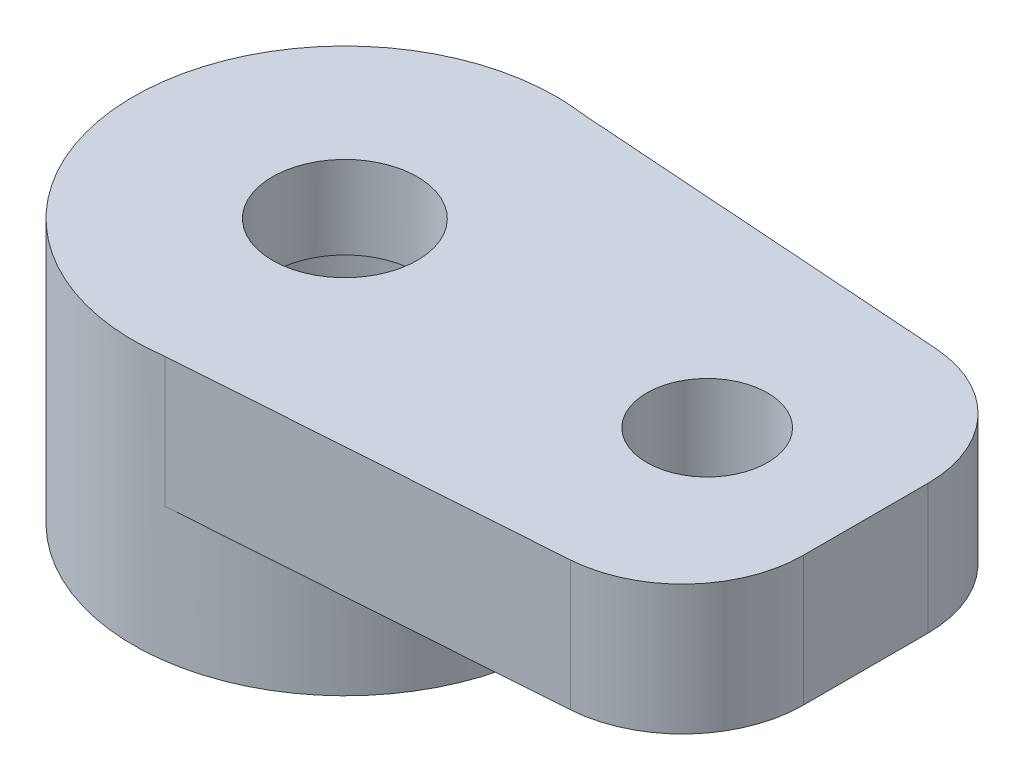
ISO-10303-21;
HEADER;
FILE_DESCRIPTION(('STEP AP214'),'2;1');
FILE_NAME('part.step','',(''),(''),'','','');
FILE_SCHEMA(('AUTOMOTIVE_DESIGN { 1 0 10303 214 1 1 1 1 }'));
ENDSEC;
DATA;
#1=APPLICATION_CONTEXT('core data for automotive mechanical design processes');
#2=APPLICATION_PROTOCOL_DEFINITION('international standard','automotive_design',2000,#1);
#3=PRODUCT_CONTEXT('',#1,'mechanical');
#4=PRODUCT('Part','Part','',(#3));
#5=PRODUCT_RELATED_PRODUCT_CATEGORY('part','',(#4));
#6=PRODUCT_DEFINITION_FORMATION('','',#4);
#7=PRODUCT_DEFINITION_CONTEXT('part definition',#1,'design');
#8=PRODUCT_DEFINITION('design','',#6,#7);
#9=PRODUCT_DEFINITION_SHAPE('','',#8);
#10=(LENGTH_UNIT() NAMED_UNIT(*) SI_UNIT(.MILLI.,.METRE.));
#11=(NAMED_UNIT(*) PLANE_ANGLE_UNIT() SI_UNIT($,.RADIAN.));
#12=(NAMED_UNIT(*) SI_UNIT($,.STERADIAN.) SOLID_ANGLE_UNIT());
#13=UNCERTAINTY_MEASURE_WITH_UNIT(LENGTH_MEASURE(1.E-05),#10,'distance_accuracy_value','');
#14=(GEOMETRIC_REPRESENTATION_CONTEXT(3) GLOBAL_UNCERTAINTY_ASSIGNED_CONTEXT((#13)) GLOBAL_UNIT_ASSIGNED_CONTEXT((#10,
#11,#12)) REPRESENTATION_CONTEXT('',''));
#15=CARTESIAN_POINT('',(0.,0.,0.));
#16=DIRECTION('',(0.,0.,1.));
#17=DIRECTION('',(1.,0.,0.));
#18=AXIS2_PLACEMENT_3D('',#15,#16,#17);
#19=CARTESIAN_POINT('',(0.,-5.07,0.));
#20=DIRECTION('',(0.,1.,0.));
#21=DIRECTION('',(0.,0.,1.));
#22=AXIS2_PLACEMENT_3D('',#19,#20,#21);
#23=CYLINDRICAL_SURFACE('',#22,1.2);
#24=CARTESIAN_POINT('',(0.,2.15,0.));
#25=DIRECTION('',(0.,1.,0.));
#26=DIRECTION('',(0.,0.,1.));
#27=AXIS2_PLACEMENT_3D('',#24,#25,#26);
#28=CIRCLE('',#27,1.2);
#29=CARTESIAN_POINT('',(0.,2.15,1.2));
#30=VERTEX_POINT('',#29);
#31=EDGE_CURVE('E105',#30,#30,#28,.T.);
#32=ORIENTED_EDGE('',*,*,#31,.T.);
#33=EDGE_LOOP('',(#32));
#34=FACE_BOUND('',#33,.T.);
#35=CARTESIAN_POINT('',(0.,0.779999999999999,0.));
#36=DIRECTION('',(0.,-1.,0.));
#37=DIRECTION('',(0.,0.,-1.));
#38=AXIS2_PLACEMENT_3D('',#35,#36,#37);
#39=CIRCLE('',#38,1.2);
#40=CARTESIAN_POINT('',(0.,0.779999999999999,-1.2));
#41=VERTEX_POINT('',#40);
#42=EDGE_CURVE('E123',#41,#41,#39,.F.);
#43=ORIENTED_EDGE('',*,*,#42,.F.);
#44=EDGE_LOOP('',(#43));
#45=FACE_BOUND('',#44,.T.);
#46=ADVANCED_FACE('F34',(#34,#45),#23,.F.);
#47=CARTESIAN_POINT('',(0.,0.,0.));
#48=DIRECTION('',(0.,1.,0.));
#49=DIRECTION('',(0.,0.,1.));
#50=AXIS2_PLACEMENT_3D('',#47,#48,#49);
#51=PLANE('',#50);
#52=CARTESIAN_POINT('',(6.,0.,0.));
#53=DIRECTION('',(0.,1.,0.));
#54=DIRECTION('',(0.,0.,1.));
#55=AXIS2_PLACEMENT_3D('',#52,#53,#54);
#56=CIRCLE('',#55,1.);
#57=CARTESIAN_POINT('',(6.,0.,1.));
#58=VERTEX_POINT('',#57);
#59=EDGE_CURVE('E160',#58,#58,#56,.T.);
#60=ORIENTED_EDGE('',*,*,#59,.T.);
#61=EDGE_LOOP('',(#60));
#62=FACE_BOUND('',#61,.T.);
#63=DIRECTION('',(0.,0.,1.));
#64=VECTOR('',#63,1.);
#65=CARTESIAN_POINT('',(8.62490729115084,0.,0.));
#66=LINE('',#65,#64);
#67=CARTESIAN_POINT('',(8.62490729115084,0.,-1.0329355785474));
#68=VERTEX_POINT('',#67);
#69=CARTESIAN_POINT('',(8.62490729115084,0.,1.0329355785474));
#70=VERTEX_POINT('',#69);
#71=EDGE_CURVE('E139',#68,#70,#66,.T.);
#72=ORIENTED_EDGE('',*,*,#71,.T.);
#73=CARTESIAN_POINT('',(6.62490729115084,0.,1.0329355785474));
#74=DIRECTION('',(0.,1.,0.));
#75=DIRECTION('',(0.,0.,1.));
#76=AXIS2_PLACEMENT_3D('',#73,#74,#75);
#77=CIRCLE('',#76,2.);
#78=CARTESIAN_POINT('',(6.76410381684892,0.,3.02808578021984));
#79=VERTEX_POINT('',#78);
#80=EDGE_CURVE('E42',#70,#79,#77,.F.);
#81=ORIENTED_EDGE('',*,*,#80,.T.);
#82=DIRECTION('',(0.997575100836221,0.,-0.0695982628490385));
#83=VECTOR('',#82,1.);
#84=CARTESIAN_POINT('',(0.486006458557588,0.,3.46609257265877));
#85=LINE('',#84,#83);
#86=CARTESIAN_POINT('',(0.486006458557588,0.,3.46609257265877));
#87=VERTEX_POINT('',#86);
#88=EDGE_CURVE('E95',#87,#79,#85,.T.);
#89=ORIENTED_EDGE('',*,*,#88,.F.);
#90=CARTESIAN_POINT('',(0.,0.,0.));
#91=DIRECTION('',(0.,-1.,0.));
#92=DIRECTION('',(0.,0.,-1.));
#93=AXIS2_PLACEMENT_3D('',#90,#91,#92);
#94=CIRCLE('',#93,3.5);
#95=CARTESIAN_POINT('',(0.486006458557588,0.,-3.46609257265877));
#96=VERTEX_POINT('',#95);
#97=EDGE_CURVE('E98',#96,#87,#94,.T.);
#98=ORIENTED_EDGE('',*,*,#97,.F.);
#99=DIRECTION('',(-0.997575100836221,0.,-0.0695982628490385));
#100=VECTOR('',#99,1.);
#101=CARTESIAN_POINT('',(0.486006458557588,0.,-3.46609257265877));
#102=LINE('',#101,#100);
#103=CARTESIAN_POINT('',(6.76410381684892,0.,-3.02808578021984));
#104=VERTEX_POINT('',#103);
#105=EDGE_CURVE('E86',#104,#96,#102,.T.);
#106=ORIENTED_EDGE('',*,*,#105,.F.);
#107=CARTESIAN_POINT('',(6.62490729115084,0.,-1.0329355785474));
#108=DIRECTION('',(0.,1.,0.));
#109=DIRECTION('',(0.,0.,1.));
#110=AXIS2_PLACEMENT_3D('',#107,#108,#109);
#111=CIRCLE('',#110,2.);
#112=EDGE_CURVE('E136',#104,#68,#111,.F.);
#113=ORIENTED_EDGE('',*,*,#112,.T.);
#114=EDGE_LOOP('',(#72,#81,#89,#98,#106,#113));
#115=FACE_BOUND('',#114,.T.);
#116=ADVANCED_FACE('F99',(#62,#115),#51,.F.);
#117=CARTESIAN_POINT('',(0.,2.15,0.));
#118=DIRECTION('',(0.,-1.,0.));
#119=DIRECTION('',(0.,0.,-1.));
#120=AXIS2_PLACEMENT_3D('',#117,#118,#119);
#121=CYLINDRICAL_SURFACE('',#120,3.5);
#122=DIRECTION('',(0.,-1.,0.));
#123=VECTOR('',#122,1.);
#124=CARTESIAN_POINT('',(0.486006458557588,2.15,-3.46609257265877));
#125=LINE('',#124,#123);
#126=CARTESIAN_POINT('',(0.486006458557588,2.15,-3.46609257265877));
#127=VERTEX_POINT('',#126);
#128=EDGE_CURVE('E90',#127,#96,#125,.T.);
#129=ORIENTED_EDGE('',*,*,#128,.T.);
#130=ORIENTED_EDGE('',*,*,#97,.T.);
#131=DIRECTION('',(0.,-1.,0.));
#132=VECTOR('',#131,1.);
#133=CARTESIAN_POINT('',(0.486006458557588,2.15,3.46609257265877));
#134=LINE('',#133,#132);
#135=CARTESIAN_POINT('',(0.486006458557588,2.15,3.46609257265877));
#136=VERTEX_POINT('',#135);
#137=EDGE_CURVE('E110',#136,#87,#134,.T.);
#138=ORIENTED_EDGE('',*,*,#137,.F.);
#139=CARTESIAN_POINT('',(0.,2.15,0.));
#140=DIRECTION('',(0.,1.,0.));
#141=DIRECTION('',(0.,0.,1.));
#142=AXIS2_PLACEMENT_3D('',#139,#140,#141);
#143=CIRCLE('',#142,3.5);
#144=EDGE_CURVE('E94',#127,#136,#143,.T.);
#145=ORIENTED_EDGE('',*,*,#144,.F.);
#146=EDGE_LOOP('',(#129,#130,#138,#145));
#147=FACE_BOUND('',#146,.T.);
#148=CARTESIAN_POINT('',(0.,-2.22,0.));
#149=DIRECTION('',(0.,-1.,0.));
#150=DIRECTION('',(0.,0.,-1.));
#151=AXIS2_PLACEMENT_3D('',#148,#149,#150);
#152=CIRCLE('',#151,3.5);
#153=CARTESIAN_POINT('',(0.,-2.22,-3.5));
#154=VERTEX_POINT('',#153);
#155=EDGE_CURVE('E104',#154,#154,#152,.T.);
#156=ORIENTED_EDGE('',*,*,#155,.F.);
#157=EDGE_LOOP('',(#156));
#158=FACE_BOUND('',#157,.T.);
#159=ADVANCED_FACE('F107',(#147,#158),#121,.T.);
#160=CARTESIAN_POINT('',(0.486006458557588,2.15,3.46609257265877));
#161=DIRECTION('',(-0.0695982628490385,0.,-0.997575100836221));
#162=DIRECTION('',(-0.997575100836221,0.,0.0695982628490385));
#163=AXIS2_PLACEMENT_3D('',#160,#161,#162);
#164=PLANE('',#163);
#165=ORIENTED_EDGE('',*,*,#88,.T.);
#166=DIRECTION('',(0.,1.,0.));
#167=VECTOR('',#166,1.);
#168=CARTESIAN_POINT('',(6.76410381684892,2.15,3.02808578021984));
#169=LINE('',#168,#167);
#170=CARTESIAN_POINT('',(6.76410381684892,2.15,3.02808578021984));
#171=VERTEX_POINT('',#170);
#172=EDGE_CURVE('E113',#79,#171,#169,.T.);
#173=ORIENTED_EDGE('',*,*,#172,.T.);
#174=DIRECTION('',(0.997575100836221,0.,-0.0695982628490385));
#175=VECTOR('',#174,1.);
#176=CARTESIAN_POINT('',(0.486006458557588,2.15,3.46609257265877));
#177=LINE('',#176,#175);
#178=EDGE_CURVE('E115',#136,#171,#177,.T.);
#179=ORIENTED_EDGE('',*,*,#178,.F.);
#180=ORIENTED_EDGE('',*,*,#137,.T.);
#181=EDGE_LOOP('',(#165,#173,#179,#180));
#182=FACE_BOUND('',#181,.T.);
#183=ADVANCED_FACE('F143',(#182),#164,.F.);
#184=CARTESIAN_POINT('',(0.486006458557588,2.15,-3.46609257265877));
#185=DIRECTION('',(-0.0695982628490385,0.,0.997575100836221));
#186=DIRECTION('',(0.997575100836221,0.,0.0695982628490385));
#187=AXIS2_PLACEMENT_3D('',#184,#185,#186);
#188=PLANE('',#187);
#189=DIRECTION('',(-0.997575100836221,0.,-0.0695982628490385));
#190=VECTOR('',#189,1.);
#191=CARTESIAN_POINT('',(0.486006458557588,2.15,-3.46609257265877));
#192=LINE('',#191,#190);
#193=CARTESIAN_POINT('',(6.76410381684892,2.15,-3.02808578021984));
#194=VERTEX_POINT('',#193);
#195=EDGE_CURVE('E111',#194,#127,#192,.T.);
#196=ORIENTED_EDGE('',*,*,#195,.F.);
#197=DIRECTION('',(0.,1.,0.));
#198=VECTOR('',#197,1.);
#199=CARTESIAN_POINT('',(6.76410381684892,2.15,-3.02808578021984));
#200=LINE('',#199,#198);
#201=EDGE_CURVE('E11',#194,#104,#200,.F.);
#202=ORIENTED_EDGE('',*,*,#201,.T.);
#203=ORIENTED_EDGE('',*,*,#105,.T.);
#204=ORIENTED_EDGE('',*,*,#128,.F.);
#205=EDGE_LOOP('',(#196,#202,#203,#204));
#206=FACE_BOUND('',#205,.T.);
#207=ADVANCED_FACE('F88',(#206),#188,.F.);
#208=CARTESIAN_POINT('',(0.,2.15,0.));
#209=DIRECTION('',(0.,1.,0.));
#210=DIRECTION('',(0.,0.,1.));
#211=AXIS2_PLACEMENT_3D('',#208,#209,#210);
#212=PLANE('',#211);
#213=ORIENTED_EDGE('',*,*,#178,.T.);
#214=CARTESIAN_POINT('',(6.62490729115084,2.15,1.0329355785474));
#215=DIRECTION('',(0.,1.,0.));
#216=DIRECTION('',(0.,0.,1.));
#217=AXIS2_PLACEMENT_3D('',#214,#215,#216);
#218=CIRCLE('',#217,2.);
#219=CARTESIAN_POINT('',(8.62490729115084,2.15,1.0329355785474));
#220=VERTEX_POINT('',#219);
#221=EDGE_CURVE('E131',#171,#220,#218,.T.);
#222=ORIENTED_EDGE('',*,*,#221,.T.);
#223=DIRECTION('',(0.,0.,1.));
#224=VECTOR('',#223,1.);
#225=CARTESIAN_POINT('',(8.62490729115084,2.15,-2.89826228201273));
#226=LINE('',#225,#224);
#227=CARTESIAN_POINT('',(8.62490729115084,2.15,-1.0329355785474));
#228=VERTEX_POINT('',#227);
#229=EDGE_CURVE('E151',#228,#220,#226,.T.);
#230=ORIENTED_EDGE('',*,*,#229,.F.);
#231=CARTESIAN_POINT('',(6.62490729115084,2.15,-1.0329355785474));
#232=DIRECTION('',(0.,1.,0.));
#233=DIRECTION('',(0.,0.,1.));
#234=AXIS2_PLACEMENT_3D('',#231,#232,#233);
#235=CIRCLE('',#234,2.);
#236=EDGE_CURVE('E129',#228,#194,#235,.T.);
#237=ORIENTED_EDGE('',*,*,#236,.T.);
#238=ORIENTED_EDGE('',*,*,#195,.T.);
#239=ORIENTED_EDGE('',*,*,#144,.T.);
#240=EDGE_LOOP('',(#213,#222,#230,#237,#238,#239));
#241=FACE_BOUND('',#240,.T.);
#242=CARTESIAN_POINT('',(6.,2.15,0.));
#243=DIRECTION('',(0.,1.,0.));
#244=DIRECTION('',(0.,0.,1.));
#245=AXIS2_PLACEMENT_3D('',#242,#243,#244);
#246=CIRCLE('',#245,1.);
#247=CARTESIAN_POINT('',(6.,2.15,1.));
#248=VERTEX_POINT('',#247);
#249=EDGE_CURVE('E155',#248,#248,#246,.T.);
#250=ORIENTED_EDGE('',*,*,#249,.F.);
#251=EDGE_LOOP('',(#250));
#252=FACE_BOUND('',#251,.T.);
#253=ORIENTED_EDGE('',*,*,#31,.F.);
#254=EDGE_LOOP('',(#253));
#255=FACE_BOUND('',#254,.T.);
#256=ADVANCED_FACE('F149',(#241,#252,#255),#212,.T.);
#257=CARTESIAN_POINT('',(0.,-2.22,0.));
#258=DIRECTION('',(0.,-1.,0.));
#259=DIRECTION('',(0.,0.,-1.));
#260=AXIS2_PLACEMENT_3D('',#257,#258,#259);
#261=PLANE('',#260);
#262=CARTESIAN_POINT('',(0.,-2.22,0.));
#263=DIRECTION('',(0.,-1.,0.));
#264=DIRECTION('',(0.,0.,-1.));
#265=AXIS2_PLACEMENT_3D('',#262,#263,#264);
#266=CIRCLE('',#265,2.175);
#267=CARTESIAN_POINT('',(0.,-2.22,-2.175));
#268=VERTEX_POINT('',#267);
#269=EDGE_CURVE('E163',#268,#268,#266,.T.);
#270=ORIENTED_EDGE('',*,*,#269,.F.);
#271=EDGE_LOOP('',(#270));
#272=FACE_BOUND('',#271,.T.);
#273=ORIENTED_EDGE('',*,*,#155,.T.);
#274=EDGE_LOOP('',(#273));
#275=FACE_BOUND('',#274,.T.);
#276=ADVANCED_FACE('F197',(#272,#275),#261,.T.);
#277=CARTESIAN_POINT('',(0.,0.78,0.));
#278=DIRECTION('',(0.,-1.,0.));
#279=DIRECTION('',(0.,0.,-1.));
#280=AXIS2_PLACEMENT_3D('',#277,#278,#279);
#281=PLANE('',#280);
#282=CARTESIAN_POINT('',(0.,0.78,0.));
#283=DIRECTION('',(0.,-1.,0.));
#284=DIRECTION('',(0.,0.,-1.));
#285=AXIS2_PLACEMENT_3D('',#282,#283,#284);
#286=CIRCLE('',#285,2.175);
#287=CARTESIAN_POINT('',(0.,0.78,-2.175));
#288=VERTEX_POINT('',#287);
#289=EDGE_CURVE('E126',#288,#288,#286,.T.);
#290=ORIENTED_EDGE('',*,*,#289,.T.);
#291=EDGE_LOOP('',(#290));
#292=FACE_BOUND('',#291,.T.);
#293=ORIENTED_EDGE('',*,*,#42,.T.);
#294=EDGE_LOOP('',(#293));
#295=FACE_BOUND('',#294,.T.);
#296=ADVANCED_FACE('F200',(#292,#295),#281,.T.);
#297=CARTESIAN_POINT('',(0.,0.78,0.));
#298=DIRECTION('',(0.,-1.,0.));
#299=DIRECTION('',(0.,0.,-1.));
#300=AXIS2_PLACEMENT_3D('',#297,#298,#299);
#301=CYLINDRICAL_SURFACE('',#300,2.175);
#302=ORIENTED_EDGE('',*,*,#289,.F.);
#303=EDGE_LOOP('',(#302));
#304=FACE_BOUND('',#303,.T.);
#305=ORIENTED_EDGE('',*,*,#269,.T.);
#306=EDGE_LOOP('',(#305));
#307=FACE_BOUND('',#306,.T.);
#308=ADVANCED_FACE('F195',(#304,#307),#301,.F.);
#309=CARTESIAN_POINT('',(6.,-7.85,0.));
#310=DIRECTION('',(0.,1.,0.));
#311=DIRECTION('',(0.,0.,1.));
#312=AXIS2_PLACEMENT_3D('',#309,#310,#311);
#313=CYLINDRICAL_SURFACE('',#312,1.);
#314=ORIENTED_EDGE('',*,*,#249,.T.);
#315=EDGE_LOOP('',(#314));
#316=FACE_BOUND('',#315,.T.);
#317=ORIENTED_EDGE('',*,*,#59,.F.);
#318=EDGE_LOOP('',(#317));
#319=FACE_BOUND('',#318,.T.);
#320=ADVANCED_FACE('F249',(#316,#319),#313,.F.);
#321=CARTESIAN_POINT('',(8.62490729115084,-7.85,-2.89826228201273));
#322=DIRECTION('',(-1.,0.,0.));
#323=DIRECTION('',(0.,0.,1.));
#324=AXIS2_PLACEMENT_3D('',#321,#322,#323);
#325=PLANE('',#324);
#326=ORIENTED_EDGE('',*,*,#229,.T.);
#327=DIRECTION('',(0.,1.,0.));
#328=VECTOR('',#327,1.);
#329=CARTESIAN_POINT('',(8.62490729115084,-7.85,1.0329355785474));
#330=LINE('',#329,#328);
#331=EDGE_CURVE('E55',#220,#70,#330,.F.);
#332=ORIENTED_EDGE('',*,*,#331,.T.);
#333=ORIENTED_EDGE('',*,*,#71,.F.);
#334=DIRECTION('',(0.,1.,0.));
#335=VECTOR('',#334,1.);
#336=CARTESIAN_POINT('',(8.62490729115084,-7.85,-1.0329355785474));
#337=LINE('',#336,#335);
#338=EDGE_CURVE('E133',#68,#228,#337,.T.);
#339=ORIENTED_EDGE('',*,*,#338,.T.);
#340=EDGE_LOOP('',(#326,#332,#333,#339));
#341=FACE_BOUND('',#340,.T.);
#342=ADVANCED_FACE('F152',(#341),#325,.F.);
#343=CARTESIAN_POINT('',(6.62490729115084,2.15,1.0329355785474));
#344=DIRECTION('',(0.,1.,0.));
#345=DIRECTION('',(0.,0.,1.));
#346=AXIS2_PLACEMENT_3D('',#343,#344,#345);
#347=CYLINDRICAL_SURFACE('',#346,2.);
#348=ORIENTED_EDGE('',*,*,#80,.F.);
#349=ORIENTED_EDGE('',*,*,#331,.F.);
#350=ORIENTED_EDGE('',*,*,#221,.F.);
#351=ORIENTED_EDGE('',*,*,#172,.F.);
#352=EDGE_LOOP('',(#348,#349,#350,#351));
#353=FACE_BOUND('',#352,.T.);
#354=ADVANCED_FACE('F146',(#353),#347,.T.);
#355=CARTESIAN_POINT('',(6.62490729115084,-7.85,-1.0329355785474));
#356=DIRECTION('',(0.,1.,0.));
#357=DIRECTION('',(0.,0.,1.));
#358=AXIS2_PLACEMENT_3D('',#355,#356,#357);
#359=CYLINDRICAL_SURFACE('',#358,2.);
#360=ORIENTED_EDGE('',*,*,#112,.F.);
#361=ORIENTED_EDGE('',*,*,#201,.F.);
#362=ORIENTED_EDGE('',*,*,#236,.F.);
#363=ORIENTED_EDGE('',*,*,#338,.F.);
#364=EDGE_LOOP('',(#360,#361,#362,#363));
#365=FACE_BOUND('',#364,.T.);
#366=ADVANCED_FACE('F36',(#365),#359,.T.);
#367=CLOSED_SHELL('',(#46,#116,#159,#183,#207,#256,#276,#296,#308,#320,#342,#354,#366));
#368=MANIFOLD_SOLID_BREP('B2',#367);
#369=ADVANCED_BREP_SHAPE_REPRESENTATION('',(#18,#368),#14);
#370=SHAPE_DEFINITION_REPRESENTATION(#9,#369);
ENDSEC;
END-ISO-10303-21;
